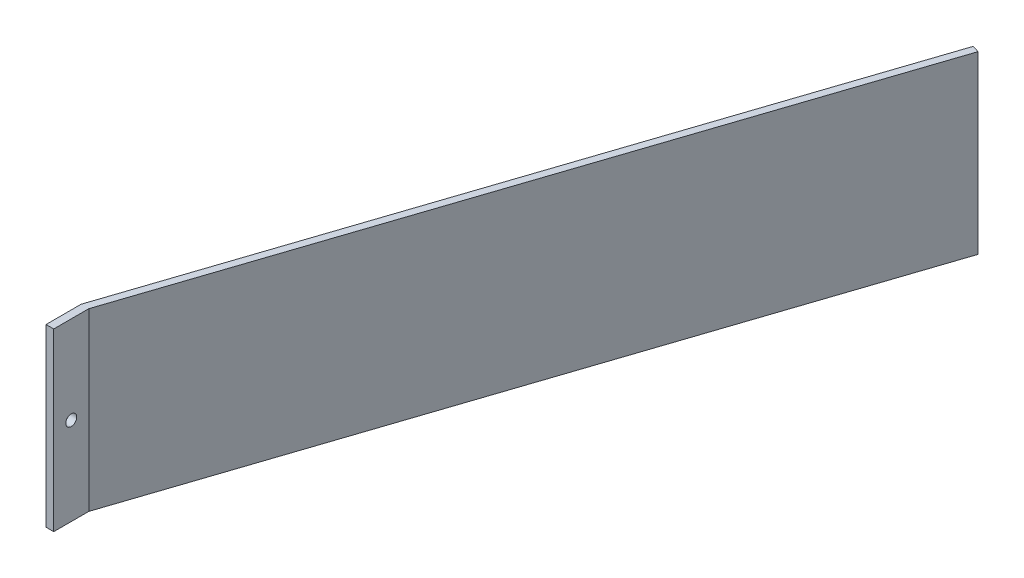
ISO-10303-21;
HEADER;
FILE_DESCRIPTION(('STEP AP214'),'2;1');
FILE_NAME('part.step','',(''),(''),'','','');
FILE_SCHEMA(('AUTOMOTIVE_DESIGN { 1 0 10303 214 1 1 1 1 }'));
ENDSEC;
DATA;
#1=APPLICATION_CONTEXT('core data for automotive mechanical design processes');
#2=APPLICATION_PROTOCOL_DEFINITION('international standard','automotive_design',2000,#1);
#3=PRODUCT_CONTEXT('',#1,'mechanical');
#4=PRODUCT('Part','Part','',(#3));
#5=PRODUCT_RELATED_PRODUCT_CATEGORY('part','',(#4));
#6=PRODUCT_DEFINITION_FORMATION('','',#4);
#7=PRODUCT_DEFINITION_CONTEXT('part definition',#1,'design');
#8=PRODUCT_DEFINITION('design','',#6,#7);
#9=PRODUCT_DEFINITION_SHAPE('','',#8);
#10=(LENGTH_UNIT() NAMED_UNIT(*) SI_UNIT(.MILLI.,.METRE.));
#11=(NAMED_UNIT(*) PLANE_ANGLE_UNIT() SI_UNIT($,.RADIAN.));
#12=(NAMED_UNIT(*) SI_UNIT($,.STERADIAN.) SOLID_ANGLE_UNIT());
#13=UNCERTAINTY_MEASURE_WITH_UNIT(LENGTH_MEASURE(1.E-05),#10,'distance_accuracy_value','');
#14=(GEOMETRIC_REPRESENTATION_CONTEXT(3) GLOBAL_UNCERTAINTY_ASSIGNED_CONTEXT((#13)) GLOBAL_UNIT_ASSIGNED_CONTEXT((#10,
#11,#12)) REPRESENTATION_CONTEXT('',''));
#15=CARTESIAN_POINT('',(0.,0.,0.));
#16=DIRECTION('',(0.,0.,1.));
#17=DIRECTION('',(1.,0.,0.));
#18=AXIS2_PLACEMENT_3D('',#15,#16,#17);
#19=CARTESIAN_POINT('',(-182.717603244824,76.2,-153.402420415433));
#20=DIRECTION('',(-0.315722965490638,0.,0.948851415692572));
#21=DIRECTION('',(0.948851415692572,0.,0.315722965490638));
#22=AXIS2_PLACEMENT_3D('',#19,#20,#21);
#23=PLANE('',#22);
#24=DIRECTION('',(-0.948851415692572,0.,-0.315722965490638));
#25=VECTOR('',#24,1.);
#26=CARTESIAN_POINT('',(-182.717603244824,0.,-153.402420415433));
#27=LINE('',#26,#25);
#28=CARTESIAN_POINT('',(-179.705,0.,-152.4));
#29=VERTEX_POINT('',#28);
#30=CARTESIAN_POINT('',(-182.717603244824,0.,-153.402420415433));
#31=VERTEX_POINT('',#30);
#32=EDGE_CURVE('E126',#29,#31,#27,.T.);
#33=ORIENTED_EDGE('',*,*,#32,.T.);
#34=DIRECTION('',(0.,-1.,0.));
#35=VECTOR('',#34,1.);
#36=CARTESIAN_POINT('',(-182.717603244824,76.2,-153.402420415433));
#37=LINE('',#36,#35);
#38=CARTESIAN_POINT('',(-182.717603244824,76.2,-153.402420415433));
#39=VERTEX_POINT('',#38);
#40=EDGE_CURVE('E11',#39,#31,#37,.T.);
#41=ORIENTED_EDGE('',*,*,#40,.F.);
#42=DIRECTION('',(-0.948851415692572,0.,-0.315722965490638));
#43=VECTOR('',#42,1.);
#44=CARTESIAN_POINT('',(-182.717603244824,76.2,-153.402420415433));
#45=LINE('',#44,#43);
#46=CARTESIAN_POINT('',(-179.705,76.2,-152.4));
#47=VERTEX_POINT('',#46);
#48=EDGE_CURVE('E136',#47,#39,#45,.T.);
#49=ORIENTED_EDGE('',*,*,#48,.F.);
#50=DIRECTION('',(0.,-1.,0.));
#51=VECTOR('',#50,1.);
#52=CARTESIAN_POINT('',(-179.705,76.2,-152.4));
#53=LINE('',#52,#51);
#54=EDGE_CURVE('E122',#47,#29,#53,.T.);
#55=ORIENTED_EDGE('',*,*,#54,.T.);
#56=EDGE_LOOP('',(#33,#41,#49,#55));
#57=FACE_BOUND('',#56,.T.);
#58=ADVANCED_FACE('F41',(#57),#23,.F.);
#59=CARTESIAN_POINT('',(-279.4,76.2,137.16));
#60=DIRECTION('',(0.94885141569257,0.,0.315722965490644));
#61=DIRECTION('',(0.315722965490644,0.,-0.94885141569257));
#62=AXIS2_PLACEMENT_3D('',#59,#60,#61);
#63=PLANE('',#62);
#64=DIRECTION('',(-0.315722965490643,0.,0.94885141569257));
#65=VECTOR('',#64,1.);
#66=CARTESIAN_POINT('',(-279.4,0.,137.16));
#67=LINE('',#66,#65);
#68=CARTESIAN_POINT('',(-279.4,0.,137.16));
#69=VERTEX_POINT('',#68);
#70=EDGE_CURVE('E129',#31,#69,#67,.T.);
#71=ORIENTED_EDGE('',*,*,#70,.T.);
#72=DIRECTION('',(0.,-1.,0.));
#73=VECTOR('',#72,1.);
#74=CARTESIAN_POINT('',(-279.4,76.2,137.16));
#75=LINE('',#74,#73);
#76=CARTESIAN_POINT('',(-279.4,76.2,137.16));
#77=VERTEX_POINT('',#76);
#78=EDGE_CURVE('E50',#77,#69,#75,.T.);
#79=ORIENTED_EDGE('',*,*,#78,.F.);
#80=DIRECTION('',(-0.315722965490643,0.,0.94885141569257));
#81=VECTOR('',#80,1.);
#82=CARTESIAN_POINT('',(-279.4,76.2,137.16));
#83=LINE('',#82,#81);
#84=EDGE_CURVE('E95',#39,#77,#83,.T.);
#85=ORIENTED_EDGE('',*,*,#84,.F.);
#86=ORIENTED_EDGE('',*,*,#40,.T.);
#87=EDGE_LOOP('',(#71,#79,#85,#86));
#88=FACE_BOUND('',#87,.T.);
#89=ADVANCED_FACE('F162',(#88),#63,.F.);
#90=CARTESIAN_POINT('',(-279.4,76.2,137.16));
#91=DIRECTION('',(1.,0.,0.));
#92=DIRECTION('',(0.,0.,-1.));
#93=AXIS2_PLACEMENT_3D('',#90,#91,#92);
#94=PLANE('',#93);
#95=CARTESIAN_POINT('',(-279.4,38.1,144.78));
#96=DIRECTION('',(-1.,0.,0.));
#97=DIRECTION('',(0.,0.,1.));
#98=AXIS2_PLACEMENT_3D('',#95,#96,#97);
#99=CIRCLE('',#98,2.38125);
#100=CARTESIAN_POINT('',(-279.4,38.1,147.16125));
#101=VERTEX_POINT('',#100);
#102=EDGE_CURVE('E247',#101,#101,#99,.T.);
#103=ORIENTED_EDGE('',*,*,#102,.F.);
#104=EDGE_LOOP('',(#103));
#105=FACE_BOUND('',#104,.T.);
#106=DIRECTION('',(0.,0.,1.));
#107=VECTOR('',#106,1.);
#108=CARTESIAN_POINT('',(-279.4,0.,137.16));
#109=LINE('',#108,#107);
#110=CARTESIAN_POINT('',(-279.4,0.,152.4));
#111=VERTEX_POINT('',#110);
#112=EDGE_CURVE('E131',#69,#111,#109,.T.);
#113=ORIENTED_EDGE('',*,*,#112,.T.);
#114=DIRECTION('',(0.,-1.,0.));
#115=VECTOR('',#114,1.);
#116=CARTESIAN_POINT('',(-279.4,76.2,152.4));
#117=LINE('',#116,#115);
#118=CARTESIAN_POINT('',(-279.4,76.2,152.4));
#119=VERTEX_POINT('',#118);
#120=EDGE_CURVE('E117',#119,#111,#117,.T.);
#121=ORIENTED_EDGE('',*,*,#120,.F.);
#122=DIRECTION('',(0.,0.,1.));
#123=VECTOR('',#122,1.);
#124=CARTESIAN_POINT('',(-279.4,76.2,137.16));
#125=LINE('',#124,#123);
#126=EDGE_CURVE('E108',#77,#119,#125,.T.);
#127=ORIENTED_EDGE('',*,*,#126,.F.);
#128=ORIENTED_EDGE('',*,*,#78,.T.);
#129=EDGE_LOOP('',(#113,#121,#127,#128));
#130=FACE_BOUND('',#129,.T.);
#131=ADVANCED_FACE('F143',(#105,#130),#94,.F.);
#132=CARTESIAN_POINT('',(-279.4,76.2,152.4));
#133=DIRECTION('',(0.,0.,-1.));
#134=DIRECTION('',(-1.,0.,0.));
#135=AXIS2_PLACEMENT_3D('',#132,#133,#134);
#136=PLANE('',#135);
#137=DIRECTION('',(1.,0.,0.));
#138=VECTOR('',#137,1.);
#139=CARTESIAN_POINT('',(-279.4,0.,152.4));
#140=LINE('',#139,#138);
#141=CARTESIAN_POINT('',(-276.053849119588,0.,152.4));
#142=VERTEX_POINT('',#141);
#143=EDGE_CURVE('E116',#111,#142,#140,.T.);
#144=ORIENTED_EDGE('',*,*,#143,.T.);
#145=DIRECTION('',(0.,-1.,0.));
#146=VECTOR('',#145,1.);
#147=CARTESIAN_POINT('',(-276.053849119588,76.2,152.4));
#148=LINE('',#147,#146);
#149=CARTESIAN_POINT('',(-276.053849119588,76.2,152.4));
#150=VERTEX_POINT('',#149);
#151=EDGE_CURVE('E113',#150,#142,#148,.T.);
#152=ORIENTED_EDGE('',*,*,#151,.F.);
#153=DIRECTION('',(1.,0.,0.));
#154=VECTOR('',#153,1.);
#155=CARTESIAN_POINT('',(-279.4,76.2,152.4));
#156=LINE('',#155,#154);
#157=EDGE_CURVE('E102',#119,#150,#156,.T.);
#158=ORIENTED_EDGE('',*,*,#157,.F.);
#159=ORIENTED_EDGE('',*,*,#120,.T.);
#160=EDGE_LOOP('',(#144,#152,#158,#159));
#161=FACE_BOUND('',#160,.T.);
#162=ADVANCED_FACE('F114',(#161),#136,.F.);
#163=CARTESIAN_POINT('',(-276.053849119588,76.2,137.16));
#164=DIRECTION('',(-1.,0.,0.));
#165=DIRECTION('',(0.,0.,1.));
#166=AXIS2_PLACEMENT_3D('',#163,#164,#165);
#167=PLANE('',#166);
#168=CARTESIAN_POINT('',(-276.053849119588,38.1,144.78));
#169=DIRECTION('',(-1.,0.,0.));
#170=DIRECTION('',(0.,0.,1.));
#171=AXIS2_PLACEMENT_3D('',#168,#169,#170);
#172=CIRCLE('',#171,2.38125);
#173=CARTESIAN_POINT('',(-276.053849119588,38.1,147.16125));
#174=VERTEX_POINT('',#173);
#175=EDGE_CURVE('E44',#174,#174,#172,.T.);
#176=ORIENTED_EDGE('',*,*,#175,.T.);
#177=EDGE_LOOP('',(#176));
#178=FACE_BOUND('',#177,.T.);
#179=DIRECTION('',(0.,0.,-1.));
#180=VECTOR('',#179,1.);
#181=CARTESIAN_POINT('',(-276.053849119588,0.,137.16));
#182=LINE('',#181,#180);
#183=CARTESIAN_POINT('',(-276.053849119588,0.,137.16));
#184=VERTEX_POINT('',#183);
#185=EDGE_CURVE('E81',#142,#184,#182,.T.);
#186=ORIENTED_EDGE('',*,*,#185,.T.);
#187=DIRECTION('',(0.,-1.,0.));
#188=VECTOR('',#187,1.);
#189=CARTESIAN_POINT('',(-276.053849119588,76.2,137.16));
#190=LINE('',#189,#188);
#191=CARTESIAN_POINT('',(-276.053849119588,76.2,137.16));
#192=VERTEX_POINT('',#191);
#193=EDGE_CURVE('E118',#192,#184,#190,.T.);
#194=ORIENTED_EDGE('',*,*,#193,.F.);
#195=DIRECTION('',(0.,0.,-1.));
#196=VECTOR('',#195,1.);
#197=CARTESIAN_POINT('',(-276.053849119588,76.2,137.16));
#198=LINE('',#197,#196);
#199=EDGE_CURVE('E106',#150,#192,#198,.T.);
#200=ORIENTED_EDGE('',*,*,#199,.F.);
#201=ORIENTED_EDGE('',*,*,#151,.T.);
#202=EDGE_LOOP('',(#186,#194,#200,#201));
#203=FACE_BOUND('',#202,.T.);
#204=ADVANCED_FACE('F120',(#178,#203),#167,.F.);
#205=CARTESIAN_POINT('',(-276.053849119588,76.2,137.16));
#206=DIRECTION('',(-0.94885141569257,0.,-0.315722965490644));
#207=DIRECTION('',(-0.315722965490644,0.,0.94885141569257));
#208=AXIS2_PLACEMENT_3D('',#205,#206,#207);
#209=PLANE('',#208);
#210=DIRECTION('',(0.315722965490644,0.,-0.94885141569257));
#211=VECTOR('',#210,1.);
#212=CARTESIAN_POINT('',(-276.053849119588,0.,137.16));
#213=LINE('',#212,#211);
#214=EDGE_CURVE('E87',#184,#29,#213,.T.);
#215=ORIENTED_EDGE('',*,*,#214,.T.);
#216=ORIENTED_EDGE('',*,*,#54,.F.);
#217=DIRECTION('',(0.315722965490644,0.,-0.94885141569257));
#218=VECTOR('',#217,1.);
#219=CARTESIAN_POINT('',(-276.053849119588,76.2,137.16));
#220=LINE('',#219,#218);
#221=EDGE_CURVE('E58',#192,#47,#220,.T.);
#222=ORIENTED_EDGE('',*,*,#221,.F.);
#223=ORIENTED_EDGE('',*,*,#193,.T.);
#224=EDGE_LOOP('',(#215,#216,#222,#223));
#225=FACE_BOUND('',#224,.T.);
#226=ADVANCED_FACE('F150',(#225),#209,.F.);
#227=CARTESIAN_POINT('',(0.,76.2,0.));
#228=DIRECTION('',(0.,1.,0.));
#229=DIRECTION('',(0.,0.,1.));
#230=AXIS2_PLACEMENT_3D('',#227,#228,#229);
#231=PLANE('',#230);
#232=ORIENTED_EDGE('',*,*,#48,.T.);
#233=ORIENTED_EDGE('',*,*,#84,.T.);
#234=ORIENTED_EDGE('',*,*,#126,.T.);
#235=ORIENTED_EDGE('',*,*,#157,.T.);
#236=ORIENTED_EDGE('',*,*,#199,.T.);
#237=ORIENTED_EDGE('',*,*,#221,.T.);
#238=EDGE_LOOP('',(#232,#233,#234,#235,#236,#237));
#239=FACE_BOUND('',#238,.T.);
#240=ADVANCED_FACE('F104',(#239),#231,.T.);
#241=CARTESIAN_POINT('',(0.,0.,0.));
#242=DIRECTION('',(0.,1.,0.));
#243=DIRECTION('',(0.,0.,1.));
#244=AXIS2_PLACEMENT_3D('',#241,#242,#243);
#245=PLANE('',#244);
#246=ORIENTED_EDGE('',*,*,#32,.F.);
#247=ORIENTED_EDGE('',*,*,#214,.F.);
#248=ORIENTED_EDGE('',*,*,#185,.F.);
#249=ORIENTED_EDGE('',*,*,#143,.F.);
#250=ORIENTED_EDGE('',*,*,#112,.F.);
#251=ORIENTED_EDGE('',*,*,#70,.F.);
#252=EDGE_LOOP('',(#246,#247,#248,#249,#250,#251));
#253=FACE_BOUND('',#252,.T.);
#254=ADVANCED_FACE('F146',(#253),#245,.F.);
#255=CARTESIAN_POINT('',(-179.705,38.1,144.78));
#256=DIRECTION('',(-1.,0.,0.));
#257=DIRECTION('',(0.,0.,1.));
#258=AXIS2_PLACEMENT_3D('',#255,#256,#257);
#259=CYLINDRICAL_SURFACE('',#258,2.38125);
#260=ORIENTED_EDGE('',*,*,#102,.T.);
#261=EDGE_LOOP('',(#260));
#262=FACE_BOUND('',#261,.T.);
#263=ORIENTED_EDGE('',*,*,#175,.F.);
#264=EDGE_LOOP('',(#263));
#265=FACE_BOUND('',#264,.T.);
#266=ADVANCED_FACE('F191',(#262,#265),#259,.F.);
#267=CLOSED_SHELL('',(#58,#89,#131,#162,#204,#226,#240,#254,#266));
#268=MANIFOLD_SOLID_BREP('B2',#267);
#269=ADVANCED_BREP_SHAPE_REPRESENTATION('',(#18,#268),#14);
#270=SHAPE_DEFINITION_REPRESENTATION(#9,#269);
ENDSEC;
END-ISO-10303-21;
